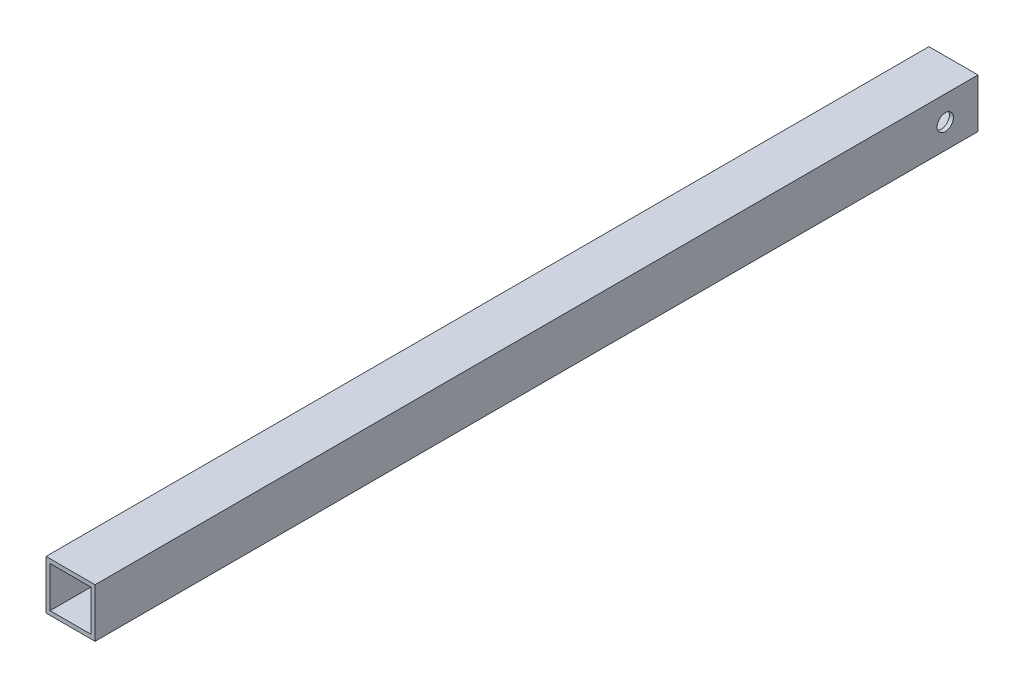
ISO-10303-21;
HEADER;
FILE_DESCRIPTION(('STEP AP214'),'2;1');
FILE_NAME('part.step','',(''),(''),'','','');
FILE_SCHEMA(('AUTOMOTIVE_DESIGN { 1 0 10303 214 1 1 1 1 }'));
ENDSEC;
DATA;
#1=APPLICATION_CONTEXT('core data for automotive mechanical design processes');
#2=APPLICATION_PROTOCOL_DEFINITION('international standard','automotive_design',2000,#1);
#3=PRODUCT_CONTEXT('',#1,'mechanical');
#4=PRODUCT('Part','Part','',(#3));
#5=PRODUCT_RELATED_PRODUCT_CATEGORY('part','',(#4));
#6=PRODUCT_DEFINITION_FORMATION('','',#4);
#7=PRODUCT_DEFINITION_CONTEXT('part definition',#1,'design');
#8=PRODUCT_DEFINITION('design','',#6,#7);
#9=PRODUCT_DEFINITION_SHAPE('','',#8);
#10=(LENGTH_UNIT() NAMED_UNIT(*) SI_UNIT(.MILLI.,.METRE.));
#11=(NAMED_UNIT(*) PLANE_ANGLE_UNIT() SI_UNIT($,.RADIAN.));
#12=(NAMED_UNIT(*) SI_UNIT($,.STERADIAN.) SOLID_ANGLE_UNIT());
#13=UNCERTAINTY_MEASURE_WITH_UNIT(LENGTH_MEASURE(1.E-05),#10,'distance_accuracy_value','');
#14=(GEOMETRIC_REPRESENTATION_CONTEXT(3) GLOBAL_UNCERTAINTY_ASSIGNED_CONTEXT((#13)) GLOBAL_UNIT_ASSIGNED_CONTEXT((#10,
#11,#12)) REPRESENTATION_CONTEXT('',''));
#15=CARTESIAN_POINT('',(0.,0.,0.));
#16=DIRECTION('',(0.,0.,1.));
#17=DIRECTION('',(1.,0.,0.));
#18=AXIS2_PLACEMENT_3D('',#15,#16,#17);
#19=CARTESIAN_POINT('',(38.1,38.1,1371.6));
#20=DIRECTION('',(0.,0.,-1.));
#21=DIRECTION('',(-1.,0.,0.));
#22=AXIS2_PLACEMENT_3D('',#19,#20,#21);
#23=PLANE('',#22);
#24=DIRECTION('',(0.,1.,0.));
#25=VECTOR('',#24,1.);
#26=CARTESIAN_POINT('',(38.1,-38.1,1371.6));
#27=LINE('',#26,#25);
#28=CARTESIAN_POINT('',(38.1,-38.1,1371.6));
#29=VERTEX_POINT('',#28);
#30=CARTESIAN_POINT('',(38.1,38.1,1371.6));
#31=VERTEX_POINT('',#30);
#32=EDGE_CURVE('E143',#29,#31,#27,.T.);
#33=ORIENTED_EDGE('',*,*,#32,.T.);
#34=DIRECTION('',(-1.,0.,0.));
#35=VECTOR('',#34,1.);
#36=CARTESIAN_POINT('',(-38.1,38.1,1371.6));
#37=LINE('',#36,#35);
#38=CARTESIAN_POINT('',(-38.1,38.1,1371.6));
#39=VERTEX_POINT('',#38);
#40=EDGE_CURVE('E146',#31,#39,#37,.T.);
#41=ORIENTED_EDGE('',*,*,#40,.T.);
#42=DIRECTION('',(0.,-1.,0.));
#43=VECTOR('',#42,1.);
#44=CARTESIAN_POINT('',(-38.1,-38.1,1371.6));
#45=LINE('',#44,#43);
#46=CARTESIAN_POINT('',(-38.1,-38.1,1371.6));
#47=VERTEX_POINT('',#46);
#48=EDGE_CURVE('E149',#39,#47,#45,.T.);
#49=ORIENTED_EDGE('',*,*,#48,.T.);
#50=DIRECTION('',(1.,0.,0.));
#51=VECTOR('',#50,1.);
#52=CARTESIAN_POINT('',(-38.1,-38.1,1371.6));
#53=LINE('',#52,#51);
#54=EDGE_CURVE('E151',#47,#29,#53,.T.);
#55=ORIENTED_EDGE('',*,*,#54,.T.);
#56=EDGE_LOOP('',(#33,#41,#49,#55));
#57=FACE_BOUND('',#56,.T.);
#58=DIRECTION('',(0.,1.,0.));
#59=VECTOR('',#58,1.);
#60=CARTESIAN_POINT('',(31.75,-31.75,1371.6));
#61=LINE('',#60,#59);
#62=CARTESIAN_POINT('',(31.75,-31.75,1371.6));
#63=VERTEX_POINT('',#62);
#64=CARTESIAN_POINT('',(31.75,31.75,1371.6));
#65=VERTEX_POINT('',#64);
#66=EDGE_CURVE('E104',#63,#65,#61,.T.);
#67=ORIENTED_EDGE('',*,*,#66,.F.);
#68=DIRECTION('',(1.,0.,0.));
#69=VECTOR('',#68,1.);
#70=CARTESIAN_POINT('',(-31.75,-31.75,1371.6));
#71=LINE('',#70,#69);
#72=CARTESIAN_POINT('',(-31.75,-31.75,1371.6));
#73=VERTEX_POINT('',#72);
#74=EDGE_CURVE('E126',#73,#63,#71,.T.);
#75=ORIENTED_EDGE('',*,*,#74,.F.);
#76=DIRECTION('',(0.,-1.,0.));
#77=VECTOR('',#76,1.);
#78=CARTESIAN_POINT('',(-31.75,-31.75,1371.6));
#79=LINE('',#78,#77);
#80=CARTESIAN_POINT('',(-31.75,31.75,1371.6));
#81=VERTEX_POINT('',#80);
#82=EDGE_CURVE('E124',#81,#73,#79,.T.);
#83=ORIENTED_EDGE('',*,*,#82,.F.);
#84=DIRECTION('',(-1.,0.,0.));
#85=VECTOR('',#84,1.);
#86=CARTESIAN_POINT('',(-31.75,31.75,1371.6));
#87=LINE('',#86,#85);
#88=EDGE_CURVE('E112',#65,#81,#87,.T.);
#89=ORIENTED_EDGE('',*,*,#88,.F.);
#90=EDGE_LOOP('',(#67,#75,#83,#89));
#91=FACE_BOUND('',#90,.T.);
#92=ADVANCED_FACE('F37',(#57,#91),#23,.F.);
#93=CARTESIAN_POINT('',(38.1,38.1,0.));
#94=DIRECTION('',(0.,0.,-1.));
#95=DIRECTION('',(-1.,0.,0.));
#96=AXIS2_PLACEMENT_3D('',#93,#94,#95);
#97=PLANE('',#96);
#98=DIRECTION('',(0.,1.,0.));
#99=VECTOR('',#98,1.);
#100=CARTESIAN_POINT('',(38.1,-38.1,0.));
#101=LINE('',#100,#99);
#102=CARTESIAN_POINT('',(38.1,-38.1,0.));
#103=VERTEX_POINT('',#102);
#104=CARTESIAN_POINT('',(38.1,38.1,0.));
#105=VERTEX_POINT('',#104);
#106=EDGE_CURVE('E120',#103,#105,#101,.T.);
#107=ORIENTED_EDGE('',*,*,#106,.F.);
#108=DIRECTION('',(1.,0.,0.));
#109=VECTOR('',#108,1.);
#110=CARTESIAN_POINT('',(-38.1,-38.1,0.));
#111=LINE('',#110,#109);
#112=CARTESIAN_POINT('',(-38.1,-38.1,0.));
#113=VERTEX_POINT('',#112);
#114=EDGE_CURVE('E147',#113,#103,#111,.T.);
#115=ORIENTED_EDGE('',*,*,#114,.F.);
#116=DIRECTION('',(0.,-1.,0.));
#117=VECTOR('',#116,1.);
#118=CARTESIAN_POINT('',(-38.1,-38.1,0.));
#119=LINE('',#118,#117);
#120=CARTESIAN_POINT('',(-38.1,38.1,0.));
#121=VERTEX_POINT('',#120);
#122=EDGE_CURVE('E158',#121,#113,#119,.T.);
#123=ORIENTED_EDGE('',*,*,#122,.F.);
#124=DIRECTION('',(-1.,0.,0.));
#125=VECTOR('',#124,1.);
#126=CARTESIAN_POINT('',(-38.1,38.1,0.));
#127=LINE('',#126,#125);
#128=EDGE_CURVE('E156',#105,#121,#127,.T.);
#129=ORIENTED_EDGE('',*,*,#128,.F.);
#130=EDGE_LOOP('',(#107,#115,#123,#129));
#131=FACE_BOUND('',#130,.T.);
#132=DIRECTION('',(1.,0.,0.));
#133=VECTOR('',#132,1.);
#134=CARTESIAN_POINT('',(-31.75,-31.75,0.));
#135=LINE('',#134,#133);
#136=CARTESIAN_POINT('',(-31.75,-31.75,0.));
#137=VERTEX_POINT('',#136);
#138=CARTESIAN_POINT('',(31.75,-31.75,0.));
#139=VERTEX_POINT('',#138);
#140=EDGE_CURVE('E113',#137,#139,#135,.T.);
#141=ORIENTED_EDGE('',*,*,#140,.T.);
#142=DIRECTION('',(0.,1.,0.));
#143=VECTOR('',#142,1.);
#144=CARTESIAN_POINT('',(31.75,-31.75,0.));
#145=LINE('',#144,#143);
#146=CARTESIAN_POINT('',(31.75,31.75,0.));
#147=VERTEX_POINT('',#146);
#148=EDGE_CURVE('E62',#139,#147,#145,.T.);
#149=ORIENTED_EDGE('',*,*,#148,.T.);
#150=DIRECTION('',(-1.,0.,0.));
#151=VECTOR('',#150,1.);
#152=CARTESIAN_POINT('',(-31.75,31.75,0.));
#153=LINE('',#152,#151);
#154=CARTESIAN_POINT('',(-31.75,31.75,0.));
#155=VERTEX_POINT('',#154);
#156=EDGE_CURVE('E119',#147,#155,#153,.T.);
#157=ORIENTED_EDGE('',*,*,#156,.T.);
#158=DIRECTION('',(0.,-1.,0.));
#159=VECTOR('',#158,1.);
#160=CARTESIAN_POINT('',(-31.75,-31.75,0.));
#161=LINE('',#160,#159);
#162=EDGE_CURVE('E134',#155,#137,#161,.T.);
#163=ORIENTED_EDGE('',*,*,#162,.T.);
#164=EDGE_LOOP('',(#141,#149,#157,#163));
#165=FACE_BOUND('',#164,.T.);
#166=ADVANCED_FACE('F178',(#131,#165),#97,.T.);
#167=CARTESIAN_POINT('',(38.1,-38.1,1371.6));
#168=DIRECTION('',(-1.,0.,0.));
#169=DIRECTION('',(0.,0.,1.));
#170=AXIS2_PLACEMENT_3D('',#167,#168,#169);
#171=PLANE('',#170);
#172=CARTESIAN_POINT('',(38.1,0.,50.8));
#173=DIRECTION('',(1.,0.,0.));
#174=DIRECTION('',(0.,0.,-1.));
#175=AXIS2_PLACEMENT_3D('',#172,#173,#174);
#176=CIRCLE('',#175,12.7);
#177=CARTESIAN_POINT('',(38.1,0.,38.1));
#178=VERTEX_POINT('',#177);
#179=EDGE_CURVE('E221',#178,#178,#176,.T.);
#180=ORIENTED_EDGE('',*,*,#179,.F.);
#181=EDGE_LOOP('',(#180));
#182=FACE_BOUND('',#181,.T.);
#183=ORIENTED_EDGE('',*,*,#106,.T.);
#184=DIRECTION('',(0.,0.,-1.));
#185=VECTOR('',#184,1.);
#186=CARTESIAN_POINT('',(38.1,38.1,1371.6));
#187=LINE('',#186,#185);
#188=EDGE_CURVE('E11',#31,#105,#187,.T.);
#189=ORIENTED_EDGE('',*,*,#188,.F.);
#190=ORIENTED_EDGE('',*,*,#32,.F.);
#191=DIRECTION('',(0.,0.,-1.));
#192=VECTOR('',#191,1.);
#193=CARTESIAN_POINT('',(38.1,-38.1,1371.6));
#194=LINE('',#193,#192);
#195=EDGE_CURVE('E153',#29,#103,#194,.T.);
#196=ORIENTED_EDGE('',*,*,#195,.T.);
#197=EDGE_LOOP('',(#183,#189,#190,#196));
#198=FACE_BOUND('',#197,.T.);
#199=ADVANCED_FACE('F39',(#182,#198),#171,.F.);
#200=CARTESIAN_POINT('',(-38.1,38.1,1371.6));
#201=DIRECTION('',(0.,-1.,0.));
#202=DIRECTION('',(0.,0.,-1.));
#203=AXIS2_PLACEMENT_3D('',#200,#201,#202);
#204=PLANE('',#203);
#205=ORIENTED_EDGE('',*,*,#128,.T.);
#206=DIRECTION('',(0.,0.,-1.));
#207=VECTOR('',#206,1.);
#208=CARTESIAN_POINT('',(-38.1,38.1,1371.6));
#209=LINE('',#208,#207);
#210=EDGE_CURVE('E47',#39,#121,#209,.T.);
#211=ORIENTED_EDGE('',*,*,#210,.F.);
#212=ORIENTED_EDGE('',*,*,#40,.F.);
#213=ORIENTED_EDGE('',*,*,#188,.T.);
#214=EDGE_LOOP('',(#205,#211,#212,#213));
#215=FACE_BOUND('',#214,.T.);
#216=ADVANCED_FACE('F188',(#215),#204,.F.);
#217=CARTESIAN_POINT('',(-38.1,-38.1,1371.6));
#218=DIRECTION('',(1.,0.,0.));
#219=DIRECTION('',(0.,0.,-1.));
#220=AXIS2_PLACEMENT_3D('',#217,#218,#219);
#221=PLANE('',#220);
#222=CARTESIAN_POINT('',(-38.1,0.,50.8));
#223=DIRECTION('',(1.,0.,0.));
#224=DIRECTION('',(0.,0.,-1.));
#225=AXIS2_PLACEMENT_3D('',#222,#223,#224);
#226=CIRCLE('',#225,12.7);
#227=CARTESIAN_POINT('',(-38.1,0.,38.1));
#228=VERTEX_POINT('',#227);
#229=EDGE_CURVE('E219',#228,#228,#226,.T.);
#230=ORIENTED_EDGE('',*,*,#229,.T.);
#231=EDGE_LOOP('',(#230));
#232=FACE_BOUND('',#231,.T.);
#233=ORIENTED_EDGE('',*,*,#122,.T.);
#234=DIRECTION('',(0.,0.,-1.));
#235=VECTOR('',#234,1.);
#236=CARTESIAN_POINT('',(-38.1,-38.1,1371.6));
#237=LINE('',#236,#235);
#238=EDGE_CURVE('E163',#47,#113,#237,.T.);
#239=ORIENTED_EDGE('',*,*,#238,.F.);
#240=ORIENTED_EDGE('',*,*,#48,.F.);
#241=ORIENTED_EDGE('',*,*,#210,.T.);
#242=EDGE_LOOP('',(#233,#239,#240,#241));
#243=FACE_BOUND('',#242,.T.);
#244=ADVANCED_FACE('F172',(#232,#243),#221,.F.);
#245=CARTESIAN_POINT('',(-38.1,-38.1,1371.6));
#246=DIRECTION('',(0.,1.,0.));
#247=DIRECTION('',(0.,0.,1.));
#248=AXIS2_PLACEMENT_3D('',#245,#246,#247);
#249=PLANE('',#248);
#250=ORIENTED_EDGE('',*,*,#114,.T.);
#251=ORIENTED_EDGE('',*,*,#195,.F.);
#252=ORIENTED_EDGE('',*,*,#54,.F.);
#253=ORIENTED_EDGE('',*,*,#238,.T.);
#254=EDGE_LOOP('',(#250,#251,#252,#253));
#255=FACE_BOUND('',#254,.T.);
#256=ADVANCED_FACE('F182',(#255),#249,.F.);
#257=CARTESIAN_POINT('',(31.75,-31.75,1371.6));
#258=DIRECTION('',(-1.,0.,0.));
#259=DIRECTION('',(0.,0.,1.));
#260=AXIS2_PLACEMENT_3D('',#257,#258,#259);
#261=PLANE('',#260);
#262=CARTESIAN_POINT('',(31.75,0.,50.8));
#263=DIRECTION('',(-1.,0.,0.));
#264=DIRECTION('',(0.,0.,1.));
#265=AXIS2_PLACEMENT_3D('',#262,#263,#264);
#266=CIRCLE('',#265,12.7);
#267=CARTESIAN_POINT('',(31.75,0.,63.5));
#268=VERTEX_POINT('',#267);
#269=EDGE_CURVE('E132',#268,#268,#266,.T.);
#270=ORIENTED_EDGE('',*,*,#269,.F.);
#271=EDGE_LOOP('',(#270));
#272=FACE_BOUND('',#271,.T.);
#273=ORIENTED_EDGE('',*,*,#148,.F.);
#274=DIRECTION('',(0.,0.,-1.));
#275=VECTOR('',#274,1.);
#276=CARTESIAN_POINT('',(31.75,-31.75,1371.6));
#277=LINE('',#276,#275);
#278=EDGE_CURVE('E108',#63,#139,#277,.T.);
#279=ORIENTED_EDGE('',*,*,#278,.F.);
#280=ORIENTED_EDGE('',*,*,#66,.T.);
#281=DIRECTION('',(0.,0.,-1.));
#282=VECTOR('',#281,1.);
#283=CARTESIAN_POINT('',(31.75,31.75,1371.6));
#284=LINE('',#283,#282);
#285=EDGE_CURVE('E107',#65,#147,#284,.T.);
#286=ORIENTED_EDGE('',*,*,#285,.T.);
#287=EDGE_LOOP('',(#273,#279,#280,#286));
#288=FACE_BOUND('',#287,.T.);
#289=ADVANCED_FACE('F106',(#272,#288),#261,.T.);
#290=CARTESIAN_POINT('',(-31.75,31.75,1371.6));
#291=DIRECTION('',(0.,-1.,0.));
#292=DIRECTION('',(0.,0.,-1.));
#293=AXIS2_PLACEMENT_3D('',#290,#291,#292);
#294=PLANE('',#293);
#295=ORIENTED_EDGE('',*,*,#156,.F.);
#296=ORIENTED_EDGE('',*,*,#285,.F.);
#297=ORIENTED_EDGE('',*,*,#88,.T.);
#298=DIRECTION('',(0.,0.,-1.));
#299=VECTOR('',#298,1.);
#300=CARTESIAN_POINT('',(-31.75,31.75,1371.6));
#301=LINE('',#300,#299);
#302=EDGE_CURVE('E121',#81,#155,#301,.T.);
#303=ORIENTED_EDGE('',*,*,#302,.T.);
#304=EDGE_LOOP('',(#295,#296,#297,#303));
#305=FACE_BOUND('',#304,.T.);
#306=ADVANCED_FACE('F116',(#305),#294,.T.);
#307=CARTESIAN_POINT('',(-31.75,-31.75,1371.6));
#308=DIRECTION('',(1.,0.,0.));
#309=DIRECTION('',(0.,1.,0.));
#310=AXIS2_PLACEMENT_3D('',#307,#308,#309);
#311=PLANE('',#310);
#312=CARTESIAN_POINT('',(-31.75,0.,50.8));
#313=DIRECTION('',(1.,0.,0.));
#314=DIRECTION('',(0.,1.,0.));
#315=AXIS2_PLACEMENT_3D('',#312,#313,#314);
#316=CIRCLE('',#315,12.7);
#317=CARTESIAN_POINT('',(-31.75,12.7,50.8));
#318=VERTEX_POINT('',#317);
#319=EDGE_CURVE('E41',#318,#318,#316,.T.);
#320=ORIENTED_EDGE('',*,*,#319,.F.);
#321=EDGE_LOOP('',(#320));
#322=FACE_BOUND('',#321,.T.);
#323=ORIENTED_EDGE('',*,*,#162,.F.);
#324=ORIENTED_EDGE('',*,*,#302,.F.);
#325=ORIENTED_EDGE('',*,*,#82,.T.);
#326=DIRECTION('',(0.,0.,-1.));
#327=VECTOR('',#326,1.);
#328=CARTESIAN_POINT('',(-31.75,-31.75,1371.6));
#329=LINE('',#328,#327);
#330=EDGE_CURVE('E54',#73,#137,#329,.T.);
#331=ORIENTED_EDGE('',*,*,#330,.T.);
#332=EDGE_LOOP('',(#323,#324,#325,#331));
#333=FACE_BOUND('',#332,.T.);
#334=ADVANCED_FACE('F214',(#322,#333),#311,.T.);
#335=CARTESIAN_POINT('',(-31.75,-31.75,1371.6));
#336=DIRECTION('',(0.,1.,0.));
#337=DIRECTION('',(0.,0.,1.));
#338=AXIS2_PLACEMENT_3D('',#335,#336,#337);
#339=PLANE('',#338);
#340=ORIENTED_EDGE('',*,*,#140,.F.);
#341=ORIENTED_EDGE('',*,*,#330,.F.);
#342=ORIENTED_EDGE('',*,*,#74,.T.);
#343=ORIENTED_EDGE('',*,*,#278,.T.);
#344=EDGE_LOOP('',(#340,#341,#342,#343));
#345=FACE_BOUND('',#344,.T.);
#346=ADVANCED_FACE('F230',(#345),#339,.T.);
#347=CARTESIAN_POINT('',(-38.1,0.,50.8));
#348=DIRECTION('',(1.,0.,0.));
#349=DIRECTION('',(0.,0.,-1.));
#350=AXIS2_PLACEMENT_3D('',#347,#348,#349);
#351=CYLINDRICAL_SURFACE('',#350,12.7);
#352=ORIENTED_EDGE('',*,*,#319,.T.);
#353=EDGE_LOOP('',(#352));
#354=FACE_BOUND('',#353,.T.);
#355=ORIENTED_EDGE('',*,*,#229,.F.);
#356=EDGE_LOOP('',(#355));
#357=FACE_BOUND('',#356,.T.);
#358=ADVANCED_FACE('F227',(#354,#357),#351,.F.);
#359=ORIENTED_EDGE('',*,*,#269,.T.);
#360=EDGE_LOOP('',(#359));
#361=FACE_BOUND('',#360,.T.);
#362=ORIENTED_EDGE('',*,*,#179,.T.);
#363=EDGE_LOOP('',(#362));
#364=FACE_BOUND('',#363,.T.);
#365=ADVANCED_FACE('F229',(#361,#364),#351,.F.);
#366=CLOSED_SHELL('',(#92,#166,#199,#216,#244,#256,#289,#306,#334,#346,#358,#365));
#367=MANIFOLD_SOLID_BREP('B2',#366);
#368=ADVANCED_BREP_SHAPE_REPRESENTATION('',(#18,#367),#14);
#369=SHAPE_DEFINITION_REPRESENTATION(#9,#368);
ENDSEC;
END-ISO-10303-21;
